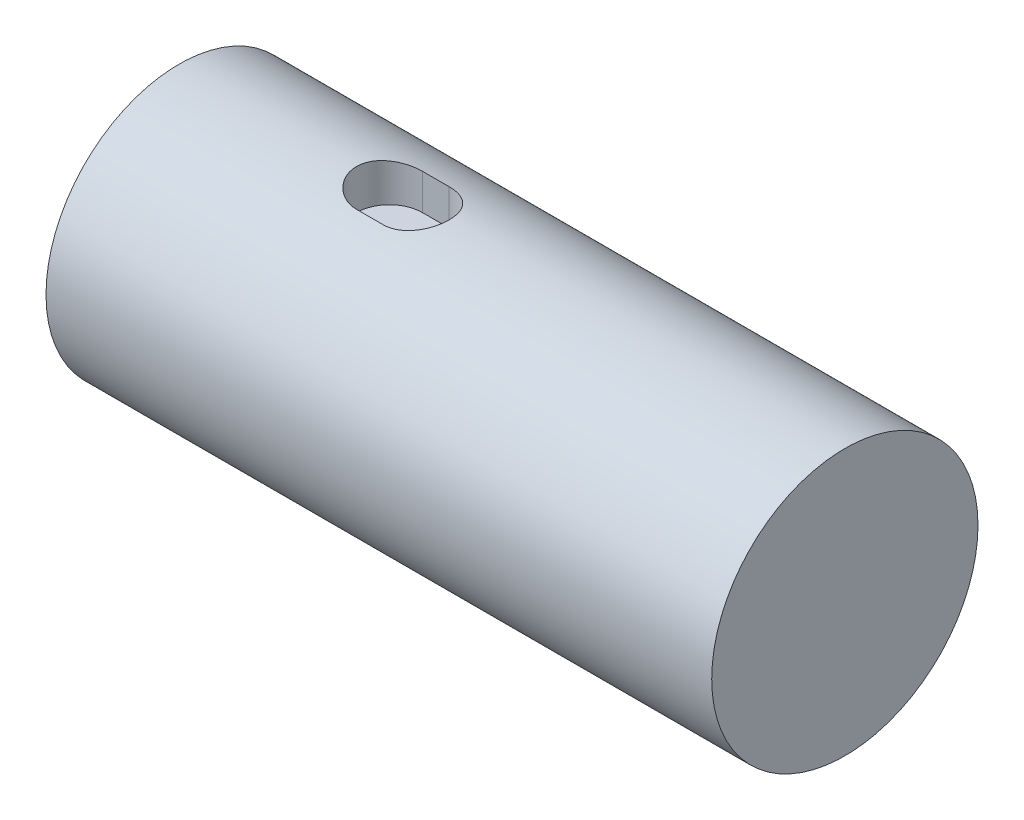
ISO-10303-21;
HEADER;
FILE_DESCRIPTION(('STEP AP214'),'2;1');
FILE_NAME('part.step','',(''),(''),'','','');
FILE_SCHEMA(('AUTOMOTIVE_DESIGN { 1 0 10303 214 1 1 1 1 }'));
ENDSEC;
DATA;
#1=APPLICATION_CONTEXT('core data for automotive mechanical design processes');
#2=APPLICATION_PROTOCOL_DEFINITION('international standard','automotive_design',2000,#1);
#3=PRODUCT_CONTEXT('',#1,'mechanical');
#4=PRODUCT('Part','Part','',(#3));
#5=PRODUCT_RELATED_PRODUCT_CATEGORY('part','',(#4));
#6=PRODUCT_DEFINITION_FORMATION('','',#4);
#7=PRODUCT_DEFINITION_CONTEXT('part definition',#1,'design');
#8=PRODUCT_DEFINITION('design','',#6,#7);
#9=PRODUCT_DEFINITION_SHAPE('','',#8);
#10=(LENGTH_UNIT() NAMED_UNIT(*) SI_UNIT(.MILLI.,.METRE.));
#11=(NAMED_UNIT(*) PLANE_ANGLE_UNIT() SI_UNIT($,.RADIAN.));
#12=(NAMED_UNIT(*) SI_UNIT($,.STERADIAN.) SOLID_ANGLE_UNIT());
#13=UNCERTAINTY_MEASURE_WITH_UNIT(LENGTH_MEASURE(1.E-05),#10,'distance_accuracy_value','');
#14=(GEOMETRIC_REPRESENTATION_CONTEXT(3) GLOBAL_UNCERTAINTY_ASSIGNED_CONTEXT((#13)) GLOBAL_UNIT_ASSIGNED_CONTEXT((#10,
#11,#12)) REPRESENTATION_CONTEXT('',''));
#15=CARTESIAN_POINT('',(0.,0.,0.));
#16=DIRECTION('',(0.,0.,1.));
#17=DIRECTION('',(1.,0.,0.));
#18=AXIS2_PLACEMENT_3D('',#15,#16,#17);
#19=CARTESIAN_POINT('',(100.,0.,0.));
#20=DIRECTION('',(-1.,0.,0.));
#21=DIRECTION('',(0.,0.,1.));
#22=AXIS2_PLACEMENT_3D('',#19,#20,#21);
#23=CYLINDRICAL_SURFACE('',#22,20.);
#24=DIRECTION('',(-1.,0.,0.));
#25=VECTOR('',#24,1.);
#26=CARTESIAN_POINT('',(100.,19.3771005315641,4.95257256278592));
#27=LINE('',#26,#25);
#28=CARTESIAN_POINT('',(31.5937639823005,19.3771005315641,4.95257256278592));
#29=VERTEX_POINT('',#28);
#30=CARTESIAN_POINT('',(35.592424808442,19.3771005315641,4.95257256278592));
#31=VERTEX_POINT('',#30);
#32=EDGE_CURVE('E11',#29,#31,#27,.F.);
#33=ORIENTED_EDGE('',*,*,#32,.F.);
#34=CARTESIAN_POINT('',(31.5937639823005,19.3771005315641,4.95257256278592));
#35=CARTESIAN_POINT('',(31.4567580349687,19.3770849367739,4.95258975762708));
#36=CARTESIAN_POINT('',(31.319757781501,19.3785530685044,4.94688816918443));
#37=CARTESIAN_POINT('',(31.0467808437664,19.3843431539535,4.92417441186834));
#38=CARTESIAN_POINT('',(30.9108039934771,19.3886646342323,4.90716411937994));
#39=CARTESIAN_POINT('',(30.6411033806557,19.4000367472591,4.86200397556893));
#40=CARTESIAN_POINT('',(30.5073757386888,19.4070820369993,4.83387593036118));
#41=CARTESIAN_POINT('',(30.2428480919039,19.4236860663213,4.76672032804958));
#42=CARTESIAN_POINT('',(30.1120481258568,19.4332448391674,4.72769262669508));
#43=CARTESIAN_POINT('',(29.8543094322864,19.4545943760055,4.63905500401204));
#44=CARTESIAN_POINT('',(29.7273695500976,19.4663844647681,4.58944828347811));
#45=CARTESIAN_POINT('',(29.4781464628638,19.4918562450136,4.48003245121976));
#46=CARTESIAN_POINT('',(29.3558650053197,19.5055386376102,4.42021955609751));
#47=CARTESIAN_POINT('',(28.9972716873336,19.5488536845906,4.22610158880832));
#48=CARTESIAN_POINT('',(28.7690043801183,19.5807722583484,4.07704587770223));
#49=CARTESIAN_POINT('',(28.3361449087225,19.6478321781095,3.74066485749026));
#50=CARTESIAN_POINT('',(28.1320952747129,19.6830238693428,3.55265589387598));
#51=CARTESIAN_POINT('',(27.758030632966,19.7522417797913,3.14509172507804));
#52=CARTESIAN_POINT('',(27.5880210547872,19.7862678123617,2.92553149688892));
#53=CARTESIAN_POINT('',(27.2847088159798,19.8498768167449,2.4574088559293));
#54=CARTESIAN_POINT('',(27.151939453773,19.8793927265958,2.20849115390512));
#55=CARTESIAN_POINT('',(26.9303350225271,19.9300752575384,1.69102918673494));
#56=CARTESIAN_POINT('',(26.8414914207092,19.9512435000408,1.42248874503779));
#57=CARTESIAN_POINT('',(26.7119925601434,19.9824878928072,0.879060268282332));
#58=CARTESIAN_POINT('',(26.6704144713061,19.992776178253,0.604404538455761));
#59=CARTESIAN_POINT('',(26.6337306454714,20.0018404165329,0.051829755093819));
#60=CARTESIAN_POINT('',(26.6386191946859,20.0006177848116,-0.226088893018059));
#61=CARTESIAN_POINT('',(26.6940636759038,19.986956159884,-0.770888149019404));
#62=CARTESIAN_POINT('',(26.7436226435687,19.974762041408,-1.03787732937307));
#63=CARTESIAN_POINT('',(26.8854086980018,19.9408108311484,-1.55962960344181));
#64=CARTESIAN_POINT('',(26.9776376520129,19.919053320872,-1.81439216158009));
#65=CARTESIAN_POINT('',(27.2029238630814,19.8680494168439,-2.30707142673037));
#66=CARTESIAN_POINT('',(27.3363380611343,19.8387379369532,-2.54481754860767));
#67=CARTESIAN_POINT('',(27.6400685907033,19.7757873449621,-2.99498269355957));
#68=CARTESIAN_POINT('',(27.8103903562906,19.7421475958873,-3.20739797991114));
#69=CARTESIAN_POINT('',(28.0924091278671,19.6906742605898,-3.50541656913314));
#70=CARTESIAN_POINT('',(28.1923438460952,19.6731083400574,-3.6024605239034));
#71=CARTESIAN_POINT('',(28.4000449873544,19.6382635540313,-3.7878060355647));
#72=CARTESIAN_POINT('',(28.5078086336393,19.6209845894064,-3.87611066610227));
#73=CARTESIAN_POINT('',(28.7305367052175,19.5871889712589,-4.04343010747333));
#74=CARTESIAN_POINT('',(28.8455058208812,19.5706728266976,-4.12243876881786));
#75=CARTESIAN_POINT('',(29.0817804790193,19.5388943200892,-4.27052004158438));
#76=CARTESIAN_POINT('',(29.2030835526383,19.52363147541,-4.33959648556306));
#77=CARTESIAN_POINT('',(29.4519505235321,19.4947180596624,-4.46769593236346));
#78=CARTESIAN_POINT('',(29.5795459034328,19.4810770783327,-4.52665996964179));
#79=CARTESIAN_POINT('',(29.8394178733555,19.4559255807911,-4.63357059105509));
#80=CARTESIAN_POINT('',(29.9716925728039,19.4444142156061,-4.681521567403));
#81=CARTESIAN_POINT('',(30.2398785378658,19.4238815949076,-4.76599560814671));
#82=CARTESIAN_POINT('',(30.375785878849,19.414857762425,-4.80253050435519));
#83=CARTESIAN_POINT('',(30.6503106035829,19.3995710764932,-4.86391216673476));
#84=CARTESIAN_POINT('',(30.7889266849414,19.3933069286865,-4.88876441271319));
#85=CARTESIAN_POINT('',(31.0386627036211,19.3847368436654,-4.92262356025701));
#86=CARTESIAN_POINT('',(31.1494671776395,19.3818769455251,-4.93385786782022));
#87=CARTESIAN_POINT('',(31.3714326510647,19.3780571783184,-4.94882936138591));
#88=CARTESIAN_POINT('',(31.4825927776866,19.3770942270457,-4.95257870926869));
#89=CARTESIAN_POINT('',(31.5937639823005,19.3771005315641,-4.95257256278592));
#90=B_SPLINE_CURVE_WITH_KNOTS('',3,(#34,#35,#36,#37,#38,#39,#40,#41,#42,#43,#44,#45,#46,#47,#48,
#49,#50,#51,#52,#53,#54,#55,#56,#57,#58,#59,#60,#61,#62,#63,#64,#65,#66,#67,#68,#69,#70,#71,#72,
#73,#74,#75,#76,#77,#78,#79,#80,#81,#82,#83,#84,#85,#86,#87,#88,#89),.UNSPECIFIED.,.F.,.F.,(4,2,
2,2,2,2,2,2,2,2,2,2,2,2,2,2,2,2,2,2,2,2,2,2,2,2,2,4),(0.,0.410882598028367,0.821697037795748,
1.23170968209744,1.64172775293657,2.05162194401288,2.46166841303283,3.28111169653244,
4.11638467758279,4.95179078288315,5.79861174548273,6.64526814456289,7.47509380883395,
8.3048174345913,9.11646950312957,9.9281570930068,10.7470868183523,11.5661372005167,
11.986940725067,12.4075957218558,12.8285274450037,13.2492963043008,13.6724408961585,
14.0954164359241,14.5179521316084,14.9402894364976,15.2742575276075,15.6076825300746),.UNSPECIFIED.);
#91=CARTESIAN_POINT('',(31.5937639823005,19.3771005315641,-4.95257256278592));
#92=VERTEX_POINT('',#91);
#93=EDGE_CURVE('E104',#29,#92,#90,.T.);
#94=ORIENTED_EDGE('',*,*,#93,.T.);
#95=DIRECTION('',(-1.,0.,0.));
#96=VECTOR('',#95,1.);
#97=CARTESIAN_POINT('',(100.,19.3771005315641,-4.95257256278592));
#98=LINE('',#97,#96);
#99=CARTESIAN_POINT('',(35.592424808442,19.3771005315641,-4.95257256278592));
#100=VERTEX_POINT('',#99);
#101=EDGE_CURVE('E41',#100,#92,#98,.T.);
#102=ORIENTED_EDGE('',*,*,#101,.F.);
#103=CARTESIAN_POINT('',(35.592424808442,19.3771005315641,-4.95257256278592));
#104=CARTESIAN_POINT('',(35.7294307557738,19.3770849367739,-4.95258975762708));
#105=CARTESIAN_POINT('',(35.8664310092416,19.3785530685044,-4.94688816918443));
#106=CARTESIAN_POINT('',(36.1394079469761,19.3843431539535,-4.92417441186834));
#107=CARTESIAN_POINT('',(36.2753847972654,19.3886646342323,-4.90716411937994));
#108=CARTESIAN_POINT('',(36.5450854100868,19.4000367472591,-4.86200397556893));
#109=CARTESIAN_POINT('',(36.6788130520538,19.4070820369993,-4.83387593036118));
#110=CARTESIAN_POINT('',(36.9433406988387,19.4236860663213,-4.76672032804958));
#111=CARTESIAN_POINT('',(37.0741406648858,19.4332448391674,-4.72769262669508));
#112=CARTESIAN_POINT('',(37.3318793584562,19.4545943760055,-4.63905500401204));
#113=CARTESIAN_POINT('',(37.458819240645,19.4663844647681,-4.58944828347811));
#114=CARTESIAN_POINT('',(37.7080423278788,19.4918562450136,-4.48003245121976));
#115=CARTESIAN_POINT('',(37.8303237854228,19.5055386376102,-4.42021955609751));
#116=CARTESIAN_POINT('',(38.1889171034089,19.5488536845906,-4.22610158880833));
#117=CARTESIAN_POINT('',(38.4171844106242,19.5807722583484,-4.07704587770223));
#118=CARTESIAN_POINT('',(38.85004388202,19.6478321781095,-3.74066485749027));
#119=CARTESIAN_POINT('',(39.0540935160296,19.6830238693428,-3.55265589387598));
#120=CARTESIAN_POINT('',(39.4281581577765,19.7522417797913,-3.14509172507804));
#121=CARTESIAN_POINT('',(39.5981677359554,19.7862678123617,-2.92553149688893));
#122=CARTESIAN_POINT('',(39.9014799747627,19.8498768167449,-2.45740885592931));
#123=CARTESIAN_POINT('',(40.0342493369696,19.8793927265958,-2.20849115390513));
#124=CARTESIAN_POINT('',(40.2558537682155,19.9300752575384,-1.69102918673495));
#125=CARTESIAN_POINT('',(40.3446973700334,19.9512435000408,-1.42248874503779));
#126=CARTESIAN_POINT('',(40.4741962305992,19.9824878928072,-0.879060268282336));
#127=CARTESIAN_POINT('',(40.5157743194365,19.992776178253,-0.604404538455764));
#128=CARTESIAN_POINT('',(40.5524581452712,20.0018404165329,-0.0518297550938222));
#129=CARTESIAN_POINT('',(40.5475695960567,20.0006177848116,0.226088893018056));
#130=CARTESIAN_POINT('',(40.4921251148388,19.986956159884,0.770888149019403));
#131=CARTESIAN_POINT('',(40.4425661471738,19.974762041408,1.03787732937307));
#132=CARTESIAN_POINT('',(40.3007800927408,19.9408108311484,1.55962960344181));
#133=CARTESIAN_POINT('',(40.2085511387297,19.919053320872,1.81439216158009));
#134=CARTESIAN_POINT('',(39.9832649276611,19.8680494168439,2.30707142673037));
#135=CARTESIAN_POINT('',(39.8498507296083,19.8387379369532,2.54481754860767));
#136=CARTESIAN_POINT('',(39.5461202000392,19.7757873449621,2.99498269355957));
#137=CARTESIAN_POINT('',(39.375798434452,19.7421475958873,3.20739797991113));
#138=CARTESIAN_POINT('',(39.0937796628755,19.6906742605898,3.50541656913313));
#139=CARTESIAN_POINT('',(38.9938449446474,19.6731083400574,3.60246052390339));
#140=CARTESIAN_POINT('',(38.7861438033882,19.6382635540313,3.7878060355647));
#141=CARTESIAN_POINT('',(38.6783801571033,19.6209845894064,3.87611066610227));
#142=CARTESIAN_POINT('',(38.455652085525,19.5871889712589,4.04343010747333));
#143=CARTESIAN_POINT('',(38.3406829698613,19.5706728266976,4.12243876881786));
#144=CARTESIAN_POINT('',(38.1044083117232,19.5388943200892,4.27052004158438));
#145=CARTESIAN_POINT('',(37.9831052381042,19.52363147541,4.33959648556306));
#146=CARTESIAN_POINT('',(37.7342382672105,19.4947180596624,4.46769593236346));
#147=CARTESIAN_POINT('',(37.6066428873097,19.4810770783327,4.52665996964179));
#148=CARTESIAN_POINT('',(37.346770917387,19.4559255807911,4.63357059105509));
#149=CARTESIAN_POINT('',(37.2144962179386,19.4444142156061,4.681521567403));
#150=CARTESIAN_POINT('',(36.9463102528768,19.4238815949076,4.76599560814671));
#151=CARTESIAN_POINT('',(36.8104029118936,19.414857762425,4.80253050435519));
#152=CARTESIAN_POINT('',(36.5358781871597,19.3995710764932,4.86391216673476));
#153=CARTESIAN_POINT('',(36.3972621058012,19.3933069286865,4.88876441271319));
#154=CARTESIAN_POINT('',(36.1475260871214,19.3847368436654,4.92262356025701));
#155=CARTESIAN_POINT('',(36.036721613103,19.3818769455251,4.93385786782022));
#156=CARTESIAN_POINT('',(35.8147561396779,19.3780571783184,4.94882936138591));
#157=CARTESIAN_POINT('',(35.703596013056,19.3770942270457,4.95257870926869));
#158=CARTESIAN_POINT('',(35.592424808442,19.3771005315641,4.95257256278592));
#159=B_SPLINE_CURVE_WITH_KNOTS('',3,(#103,#104,#105,#106,#107,#108,#109,#110,#111,#112,#113,
#114,#115,#116,#117,#118,#119,#120,#121,#122,#123,#124,#125,#126,#127,#128,#129,#130,#131,#132,
#133,#134,#135,#136,#137,#138,#139,#140,#141,#142,#143,#144,#145,#146,#147,#148,#149,#150,#151,
#152,#153,#154,#155,#156,#157,#158),.UNSPECIFIED.,.F.,.F.,(4,2,2,2,2,2,2,2,2,2,2,2,2,2,2,2,2,2,
2,2,2,2,2,2,2,2,2,4),(0.,0.410882598028363,0.821697037795752,1.23170968209744,1.64172775293657,
2.05162194401288,2.46166841303282,3.28111169653244,4.11638467758279,4.95179078288314,
5.79861174548272,6.64526814456288,7.47509380883395,8.30481743459129,9.11646950312957,
9.92815709300679,10.7470868183523,11.5661372005167,11.986940725067,12.4075957218558,
12.8285274450036,13.2492963043008,13.6724408961585,14.0954164359241,14.5179521316083,
14.9402894364976,15.2742575276075,15.6076825300746),.UNSPECIFIED.);
#160=EDGE_CURVE('E56',#100,#31,#159,.T.);
#161=ORIENTED_EDGE('',*,*,#160,.T.);
#162=EDGE_LOOP('',(#33,#94,#102,#161));
#163=FACE_BOUND('',#162,.T.);
#164=CARTESIAN_POINT('',(100.,0.,0.));
#165=DIRECTION('',(1.,0.,0.));
#166=DIRECTION('',(0.,0.,-1.));
#167=AXIS2_PLACEMENT_3D('',#164,#165,#166);
#168=CIRCLE('',#167,20.);
#169=CARTESIAN_POINT('',(100.,0.,-20.));
#170=VERTEX_POINT('',#169);
#171=EDGE_CURVE('E101',#170,#170,#168,.T.);
#172=ORIENTED_EDGE('',*,*,#171,.F.);
#173=EDGE_LOOP('',(#172));
#174=FACE_BOUND('',#173,.T.);
#175=CARTESIAN_POINT('',(0.,0.,0.));
#176=DIRECTION('',(1.,0.,0.));
#177=DIRECTION('',(0.,0.,-1.));
#178=AXIS2_PLACEMENT_3D('',#175,#176,#177);
#179=CIRCLE('',#178,20.);
#180=CARTESIAN_POINT('',(0.,0.,-20.));
#181=VERTEX_POINT('',#180);
#182=EDGE_CURVE('E85',#181,#181,#179,.T.);
#183=ORIENTED_EDGE('',*,*,#182,.T.);
#184=EDGE_LOOP('',(#183));
#185=FACE_BOUND('',#184,.T.);
#186=ADVANCED_FACE('F33',(#163,#174,#185),#23,.T.);
#187=CARTESIAN_POINT('',(100.,0.,0.));
#188=DIRECTION('',(1.,0.,0.));
#189=DIRECTION('',(0.,0.,-1.));
#190=AXIS2_PLACEMENT_3D('',#187,#188,#189);
#191=PLANE('',#190);
#192=ORIENTED_EDGE('',*,*,#171,.T.);
#193=EDGE_LOOP('',(#192));
#194=FACE_BOUND('',#193,.T.);
#195=ADVANCED_FACE('F131',(#194),#191,.T.);
#196=CARTESIAN_POINT('',(0.,0.,0.));
#197=DIRECTION('',(1.,0.,0.));
#198=DIRECTION('',(0.,0.,-1.));
#199=AXIS2_PLACEMENT_3D('',#196,#197,#198);
#200=PLANE('',#199);
#201=ORIENTED_EDGE('',*,*,#182,.F.);
#202=EDGE_LOOP('',(#201));
#203=FACE_BOUND('',#202,.T.);
#204=ADVANCED_FACE('F130',(#203),#200,.F.);
#205=CARTESIAN_POINT('',(400000.,14.,-4.95257256278592));
#206=DIRECTION('',(0.,0.,1.));
#207=DIRECTION('',(1.,0.,0.));
#208=AXIS2_PLACEMENT_3D('',#205,#206,#207);
#209=PLANE('',#208);
#210=ORIENTED_EDGE('',*,*,#101,.T.);
#211=DIRECTION('',(0.,1.,0.));
#212=VECTOR('',#211,1.);
#213=CARTESIAN_POINT('',(31.5937639823005,14.,-4.95257256278592));
#214=LINE('',#213,#212);
#215=CARTESIAN_POINT('',(31.5937639823005,14.,-4.95257256278592));
#216=VERTEX_POINT('',#215);
#217=EDGE_CURVE('E48',#216,#92,#214,.T.);
#218=ORIENTED_EDGE('',*,*,#217,.F.);
#219=DIRECTION('',(1.,0.,0.));
#220=VECTOR('',#219,1.);
#221=CARTESIAN_POINT('',(400000.,14.,-4.95257256278592));
#222=LINE('',#221,#220);
#223=CARTESIAN_POINT('',(35.592424808442,14.,-4.95257256278592));
#224=VERTEX_POINT('',#223);
#225=EDGE_CURVE('E74',#216,#224,#222,.T.);
#226=ORIENTED_EDGE('',*,*,#225,.T.);
#227=DIRECTION('',(0.,1.,0.));
#228=VECTOR('',#227,1.);
#229=CARTESIAN_POINT('',(35.592424808442,14.,-4.95257256278592));
#230=LINE('',#229,#228);
#231=EDGE_CURVE('E76',#224,#100,#230,.T.);
#232=ORIENTED_EDGE('',*,*,#231,.T.);
#233=EDGE_LOOP('',(#210,#218,#226,#232));
#234=FACE_BOUND('',#233,.T.);
#235=ADVANCED_FACE('F75',(#234),#209,.T.);
#236=CARTESIAN_POINT('',(35.592424808442,14.,0.));
#237=DIRECTION('',(0.,1.,0.));
#238=DIRECTION('',(0.,0.,1.));
#239=AXIS2_PLACEMENT_3D('',#236,#237,#238);
#240=CYLINDRICAL_SURFACE('',#239,4.95257256278592);
#241=ORIENTED_EDGE('',*,*,#231,.F.);
#242=CARTESIAN_POINT('',(35.592424808442,14.,0.));
#243=DIRECTION('',(0.,1.,0.));
#244=DIRECTION('',(0.,0.,1.));
#245=AXIS2_PLACEMENT_3D('',#242,#243,#244);
#246=CIRCLE('',#245,4.95257256278592);
#247=CARTESIAN_POINT('',(35.592424808442,14.,4.95257256278592));
#248=VERTEX_POINT('',#247);
#249=EDGE_CURVE('E81',#248,#224,#246,.T.);
#250=ORIENTED_EDGE('',*,*,#249,.F.);
#251=DIRECTION('',(0.,1.,0.));
#252=VECTOR('',#251,1.);
#253=CARTESIAN_POINT('',(35.592424808442,14.,4.95257256278592));
#254=LINE('',#253,#252);
#255=EDGE_CURVE('E86',#248,#31,#254,.T.);
#256=ORIENTED_EDGE('',*,*,#255,.T.);
#257=ORIENTED_EDGE('',*,*,#160,.F.);
#258=EDGE_LOOP('',(#241,#250,#256,#257));
#259=FACE_BOUND('',#258,.T.);
#260=ADVANCED_FACE('F84',(#259),#240,.F.);
#261=CARTESIAN_POINT('',(400000.,14.,4.95257256278592));
#262=DIRECTION('',(0.,0.,-1.));
#263=DIRECTION('',(-1.,0.,0.));
#264=AXIS2_PLACEMENT_3D('',#261,#262,#263);
#265=PLANE('',#264);
#266=ORIENTED_EDGE('',*,*,#32,.T.);
#267=ORIENTED_EDGE('',*,*,#255,.F.);
#268=DIRECTION('',(-1.,0.,0.));
#269=VECTOR('',#268,1.);
#270=CARTESIAN_POINT('',(400000.,14.,4.95257256278592));
#271=LINE('',#270,#269);
#272=CARTESIAN_POINT('',(31.5937639823005,14.,4.95257256278592));
#273=VERTEX_POINT('',#272);
#274=EDGE_CURVE('E90',#248,#273,#271,.T.);
#275=ORIENTED_EDGE('',*,*,#274,.T.);
#276=DIRECTION('',(0.,1.,0.));
#277=VECTOR('',#276,1.);
#278=CARTESIAN_POINT('',(31.5937639823005,14.,4.95257256278592));
#279=LINE('',#278,#277);
#280=EDGE_CURVE('E97',#273,#29,#279,.T.);
#281=ORIENTED_EDGE('',*,*,#280,.T.);
#282=EDGE_LOOP('',(#266,#267,#275,#281));
#283=FACE_BOUND('',#282,.T.);
#284=ADVANCED_FACE('F122',(#283),#265,.T.);
#285=CARTESIAN_POINT('',(31.5937639823005,14.,0.));
#286=DIRECTION('',(0.,1.,0.));
#287=DIRECTION('',(0.,0.,1.));
#288=AXIS2_PLACEMENT_3D('',#285,#286,#287);
#289=CYLINDRICAL_SURFACE('',#288,4.95257256278592);
#290=ORIENTED_EDGE('',*,*,#280,.F.);
#291=CARTESIAN_POINT('',(31.5937639823005,14.,0.));
#292=DIRECTION('',(0.,1.,0.));
#293=DIRECTION('',(0.,0.,1.));
#294=AXIS2_PLACEMENT_3D('',#291,#292,#293);
#295=CIRCLE('',#294,4.95257256278592);
#296=EDGE_CURVE('E92',#216,#273,#295,.T.);
#297=ORIENTED_EDGE('',*,*,#296,.F.);
#298=ORIENTED_EDGE('',*,*,#217,.T.);
#299=ORIENTED_EDGE('',*,*,#93,.F.);
#300=EDGE_LOOP('',(#290,#297,#298,#299));
#301=FACE_BOUND('',#300,.T.);
#302=ADVANCED_FACE('F117',(#301),#289,.F.);
#303=CARTESIAN_POINT('',(35.592424808442,14.,0.));
#304=DIRECTION('',(0.,1.,0.));
#305=DIRECTION('',(0.,0.,1.));
#306=AXIS2_PLACEMENT_3D('',#303,#304,#305);
#307=PLANE('',#306);
#308=ORIENTED_EDGE('',*,*,#225,.F.);
#309=ORIENTED_EDGE('',*,*,#296,.T.);
#310=ORIENTED_EDGE('',*,*,#274,.F.);
#311=ORIENTED_EDGE('',*,*,#249,.T.);
#312=EDGE_LOOP('',(#308,#309,#310,#311));
#313=FACE_BOUND('',#312,.T.);
#314=ADVANCED_FACE('F89',(#313),#307,.T.);
#315=CLOSED_SHELL('',(#186,#195,#204,#235,#260,#284,#302,#314));
#316=MANIFOLD_SOLID_BREP('B2',#315);
#317=ADVANCED_BREP_SHAPE_REPRESENTATION('',(#18,#316),#14);
#318=SHAPE_DEFINITION_REPRESENTATION(#9,#317);
ENDSEC;
END-ISO-10303-21;
